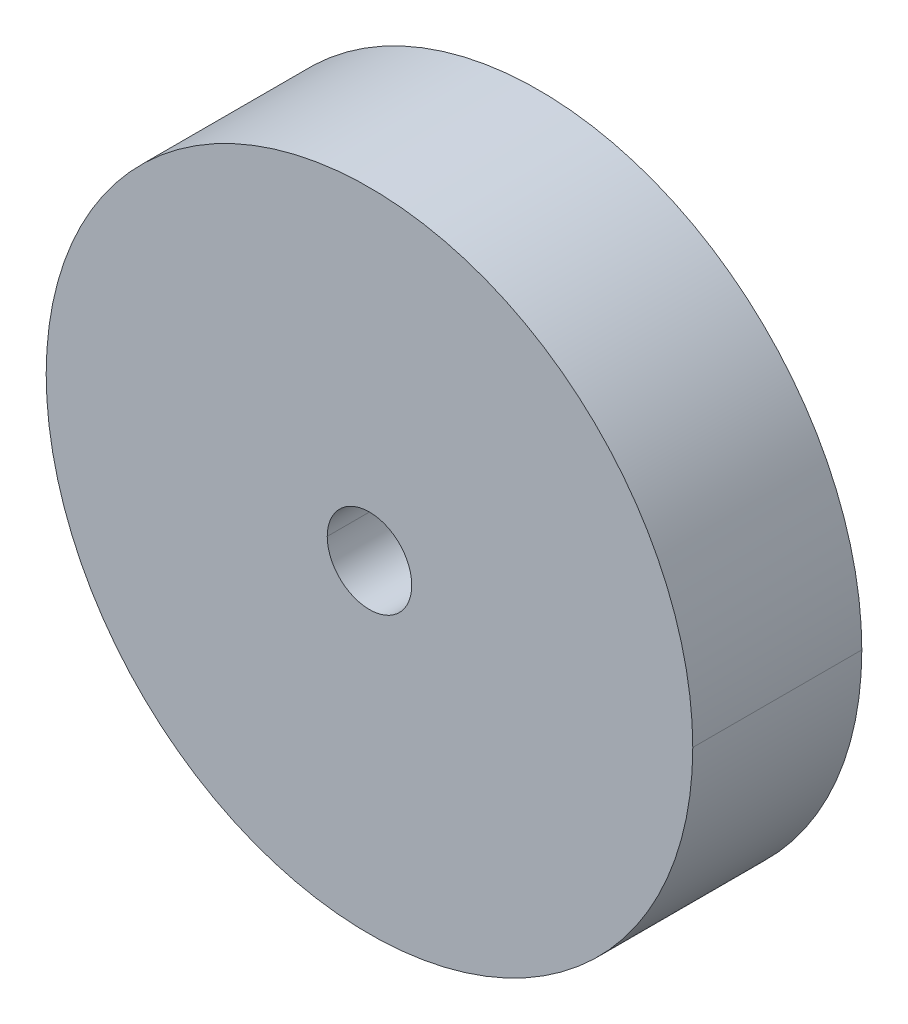
ISO-10303-21;
HEADER;
FILE_DESCRIPTION(('STEP AP214'),'2;1');
FILE_NAME('part.step','',(''),(''),'','','');
FILE_SCHEMA(('AUTOMOTIVE_DESIGN { 1 0 10303 214 1 1 1 1 }'));
ENDSEC;
DATA;
#1=APPLICATION_CONTEXT('core data for automotive mechanical design processes');
#2=APPLICATION_PROTOCOL_DEFINITION('international standard','automotive_design',2000,#1);
#3=PRODUCT_CONTEXT('',#1,'mechanical');
#4=PRODUCT('Part','Part','',(#3));
#5=PRODUCT_RELATED_PRODUCT_CATEGORY('part','',(#4));
#6=PRODUCT_DEFINITION_FORMATION('','',#4);
#7=PRODUCT_DEFINITION_CONTEXT('part definition',#1,'design');
#8=PRODUCT_DEFINITION('design','',#6,#7);
#9=PRODUCT_DEFINITION_SHAPE('','',#8);
#10=(LENGTH_UNIT() NAMED_UNIT(*) SI_UNIT(.MILLI.,.METRE.));
#11=(NAMED_UNIT(*) PLANE_ANGLE_UNIT() SI_UNIT($,.RADIAN.));
#12=(NAMED_UNIT(*) SI_UNIT($,.STERADIAN.) SOLID_ANGLE_UNIT());
#13=UNCERTAINTY_MEASURE_WITH_UNIT(LENGTH_MEASURE(1.E-05),#10,'distance_accuracy_value','');
#14=(GEOMETRIC_REPRESENTATION_CONTEXT(3) GLOBAL_UNCERTAINTY_ASSIGNED_CONTEXT((#13)) GLOBAL_UNIT_ASSIGNED_CONTEXT((#10,
#11,#12)) REPRESENTATION_CONTEXT('',''));
#15=CARTESIAN_POINT('',(0.,0.,0.));
#16=DIRECTION('',(0.,0.,1.));
#17=DIRECTION('',(1.,0.,0.));
#18=AXIS2_PLACEMENT_3D('',#15,#16,#17);
#19=CARTESIAN_POINT('',(0.,0.,2.));
#20=DIRECTION('',(0.,0.,-1.));
#21=DIRECTION('',(-1.,0.,0.));
#22=AXIS2_PLACEMENT_3D('',#19,#20,#21);
#23=CYLINDRICAL_SURFACE('',#22,0.5);
#24=DIRECTION('',(0.,0.,-1.));
#25=VECTOR('',#24,1.);
#26=CARTESIAN_POINT('',(0.5,0.,2.));
#27=LINE('',#26,#25);
#28=CARTESIAN_POINT('',(0.5,0.,2.));
#29=VERTEX_POINT('',#28);
#30=CARTESIAN_POINT('',(0.5,0.,0.));
#31=VERTEX_POINT('',#30);
#32=EDGE_CURVE('E75',#29,#31,#27,.T.);
#33=ORIENTED_EDGE('',*,*,#32,.F.);
#34=CARTESIAN_POINT('',(0.,0.,2.));
#35=DIRECTION('',(0.,0.,1.));
#36=DIRECTION('',(1.,0.,0.));
#37=AXIS2_PLACEMENT_3D('',#34,#35,#36);
#38=CIRCLE('',#37,0.5);
#39=CARTESIAN_POINT('',(-0.5,0.,2.));
#40=VERTEX_POINT('',#39);
#41=EDGE_CURVE('E63',#29,#40,#38,.T.);
#42=ORIENTED_EDGE('',*,*,#41,.T.);
#43=DIRECTION('',(0.,0.,-1.));
#44=VECTOR('',#43,1.);
#45=CARTESIAN_POINT('',(-0.5,0.,2.));
#46=LINE('',#45,#44);
#47=CARTESIAN_POINT('',(-0.5,0.,0.));
#48=VERTEX_POINT('',#47);
#49=EDGE_CURVE('E72',#40,#48,#46,.T.);
#50=ORIENTED_EDGE('',*,*,#49,.T.);
#51=CARTESIAN_POINT('',(0.,0.,0.));
#52=DIRECTION('',(0.,0.,1.));
#53=DIRECTION('',(1.,0.,0.));
#54=AXIS2_PLACEMENT_3D('',#51,#52,#53);
#55=CIRCLE('',#54,0.5);
#56=EDGE_CURVE('E10',#31,#48,#55,.T.);
#57=ORIENTED_EDGE('',*,*,#56,.F.);
#58=EDGE_LOOP('',(#33,#42,#50,#57));
#59=FACE_BOUND('',#58,.T.);
#60=ADVANCED_FACE('F16',(#59),#23,.F.);
#61=CARTESIAN_POINT('',(0.,0.,2.));
#62=DIRECTION('',(0.,0.,-1.));
#63=DIRECTION('',(-1.,0.,0.));
#64=AXIS2_PLACEMENT_3D('',#61,#62,#63);
#65=CYLINDRICAL_SURFACE('',#64,3.825);
#66=DIRECTION('',(0.,0.,-1.));
#67=VECTOR('',#66,1.);
#68=CARTESIAN_POINT('',(3.825,0.,2.));
#69=LINE('',#68,#67);
#70=CARTESIAN_POINT('',(3.825,0.,2.));
#71=VERTEX_POINT('',#70);
#72=CARTESIAN_POINT('',(3.825,0.,0.));
#73=VERTEX_POINT('',#72);
#74=EDGE_CURVE('E106',#71,#73,#69,.T.);
#75=ORIENTED_EDGE('',*,*,#74,.F.);
#76=CARTESIAN_POINT('',(0.,0.,2.));
#77=DIRECTION('',(0.,0.,1.));
#78=DIRECTION('',(1.,0.,0.));
#79=AXIS2_PLACEMENT_3D('',#76,#77,#78);
#80=CIRCLE('',#79,3.825);
#81=CARTESIAN_POINT('',(-3.825,0.,2.));
#82=VERTEX_POINT('',#81);
#83=EDGE_CURVE('E78',#82,#71,#80,.T.);
#84=ORIENTED_EDGE('',*,*,#83,.F.);
#85=DIRECTION('',(0.,0.,-1.));
#86=VECTOR('',#85,1.);
#87=CARTESIAN_POINT('',(-3.825,0.,2.));
#88=LINE('',#87,#86);
#89=CARTESIAN_POINT('',(-3.825,0.,0.));
#90=VERTEX_POINT('',#89);
#91=EDGE_CURVE('E20',#82,#90,#88,.T.);
#92=ORIENTED_EDGE('',*,*,#91,.T.);
#93=CARTESIAN_POINT('',(0.,0.,0.));
#94=DIRECTION('',(0.,0.,1.));
#95=DIRECTION('',(1.,0.,0.));
#96=AXIS2_PLACEMENT_3D('',#93,#94,#95);
#97=CIRCLE('',#96,3.825);
#98=EDGE_CURVE('E27',#90,#73,#97,.T.);
#99=ORIENTED_EDGE('',*,*,#98,.T.);
#100=EDGE_LOOP('',(#75,#84,#92,#99));
#101=FACE_BOUND('',#100,.T.);
#102=ADVANCED_FACE('F18',(#101),#65,.T.);
#103=CARTESIAN_POINT('',(0.,0.,0.));
#104=DIRECTION('',(0.,0.,1.));
#105=DIRECTION('',(1.,0.,0.));
#106=AXIS2_PLACEMENT_3D('',#103,#104,#105);
#107=PLANE('',#106);
#108=CARTESIAN_POINT('',(0.,0.,0.));
#109=DIRECTION('',(0.,0.,1.));
#110=DIRECTION('',(1.,0.,0.));
#111=AXIS2_PLACEMENT_3D('',#108,#109,#110);
#112=CIRCLE('',#111,0.5);
#113=EDGE_CURVE('E84',#48,#31,#112,.T.);
#114=ORIENTED_EDGE('',*,*,#113,.T.);
#115=ORIENTED_EDGE('',*,*,#56,.T.);
#116=EDGE_LOOP('',(#114,#115));
#117=FACE_BOUND('',#116,.T.);
#118=ORIENTED_EDGE('',*,*,#98,.F.);
#119=CARTESIAN_POINT('',(0.,0.,0.));
#120=DIRECTION('',(0.,0.,1.));
#121=DIRECTION('',(1.,0.,0.));
#122=AXIS2_PLACEMENT_3D('',#119,#120,#121);
#123=CIRCLE('',#122,3.825);
#124=EDGE_CURVE('E107',#73,#90,#123,.T.);
#125=ORIENTED_EDGE('',*,*,#124,.F.);
#126=EDGE_LOOP('',(#118,#125));
#127=FACE_BOUND('',#126,.T.);
#128=ADVANCED_FACE('F131',(#117,#127),#107,.F.);
#129=CARTESIAN_POINT('',(0.,0.,2.));
#130=DIRECTION('',(0.,0.,1.));
#131=DIRECTION('',(1.,0.,0.));
#132=AXIS2_PLACEMENT_3D('',#129,#130,#131);
#133=PLANE('',#132);
#134=CARTESIAN_POINT('',(0.,0.,2.));
#135=DIRECTION('',(0.,0.,1.));
#136=DIRECTION('',(1.,0.,0.));
#137=AXIS2_PLACEMENT_3D('',#134,#135,#136);
#138=CIRCLE('',#137,0.5);
#139=EDGE_CURVE('E82',#40,#29,#138,.T.);
#140=ORIENTED_EDGE('',*,*,#139,.F.);
#141=ORIENTED_EDGE('',*,*,#41,.F.);
#142=EDGE_LOOP('',(#140,#141));
#143=FACE_BOUND('',#142,.T.);
#144=ORIENTED_EDGE('',*,*,#83,.T.);
#145=CARTESIAN_POINT('',(0.,0.,2.));
#146=DIRECTION('',(0.,0.,1.));
#147=DIRECTION('',(1.,0.,0.));
#148=AXIS2_PLACEMENT_3D('',#145,#146,#147);
#149=CIRCLE('',#148,3.825);
#150=EDGE_CURVE('E86',#71,#82,#149,.T.);
#151=ORIENTED_EDGE('',*,*,#150,.T.);
#152=EDGE_LOOP('',(#144,#151));
#153=FACE_BOUND('',#152,.T.);
#154=ADVANCED_FACE('F87',(#143,#153),#133,.T.);
#155=CARTESIAN_POINT('',(0.,0.,2.));
#156=DIRECTION('',(0.,0.,-1.));
#157=DIRECTION('',(-1.,0.,0.));
#158=AXIS2_PLACEMENT_3D('',#155,#156,#157);
#159=CYLINDRICAL_SURFACE('',#158,3.825);
#160=ORIENTED_EDGE('',*,*,#150,.F.);
#161=ORIENTED_EDGE('',*,*,#74,.T.);
#162=ORIENTED_EDGE('',*,*,#124,.T.);
#163=ORIENTED_EDGE('',*,*,#91,.F.);
#164=EDGE_LOOP('',(#160,#161,#162,#163));
#165=FACE_BOUND('',#164,.T.);
#166=ADVANCED_FACE('F122',(#165),#159,.T.);
#167=CARTESIAN_POINT('',(0.,0.,2.));
#168=DIRECTION('',(0.,0.,-1.));
#169=DIRECTION('',(-1.,0.,0.));
#170=AXIS2_PLACEMENT_3D('',#167,#168,#169);
#171=CYLINDRICAL_SURFACE('',#170,0.5);
#172=ORIENTED_EDGE('',*,*,#139,.T.);
#173=ORIENTED_EDGE('',*,*,#32,.T.);
#174=ORIENTED_EDGE('',*,*,#113,.F.);
#175=ORIENTED_EDGE('',*,*,#49,.F.);
#176=EDGE_LOOP('',(#172,#173,#174,#175));
#177=FACE_BOUND('',#176,.T.);
#178=ADVANCED_FACE('F81',(#177),#171,.F.);
#179=CLOSED_SHELL('',(#60,#102,#128,#154,#166,#178));
#180=MANIFOLD_SOLID_BREP('B1',#179);
#181=ADVANCED_BREP_SHAPE_REPRESENTATION('',(#18,#180),#14);
#182=SHAPE_DEFINITION_REPRESENTATION(#9,#181);
ENDSEC;
END-ISO-10303-21;
